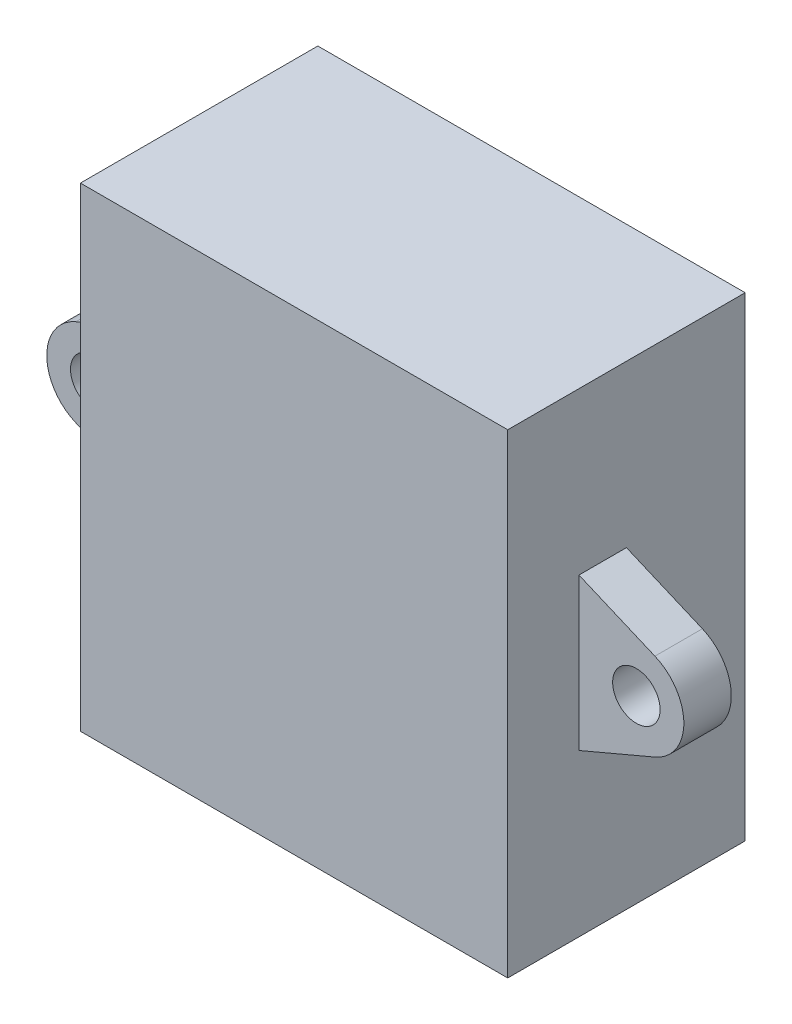
ISO-10303-21;
HEADER;
FILE_DESCRIPTION(('STEP AP214'),'2;1');
FILE_NAME('part.step','',(''),(''),'','','');
FILE_SCHEMA(('AUTOMOTIVE_DESIGN { 1 0 10303 214 1 1 1 1 }'));
ENDSEC;
DATA;
#1=APPLICATION_CONTEXT('core data for automotive mechanical design processes');
#2=APPLICATION_PROTOCOL_DEFINITION('international standard','automotive_design',2000,#1);
#3=PRODUCT_CONTEXT('',#1,'mechanical');
#4=PRODUCT('Part','Part','',(#3));
#5=PRODUCT_RELATED_PRODUCT_CATEGORY('part','',(#4));
#6=PRODUCT_DEFINITION_FORMATION('','',#4);
#7=PRODUCT_DEFINITION_CONTEXT('part definition',#1,'design');
#8=PRODUCT_DEFINITION('design','',#6,#7);
#9=PRODUCT_DEFINITION_SHAPE('','',#8);
#10=(LENGTH_UNIT() NAMED_UNIT(*) SI_UNIT(.MILLI.,.METRE.));
#11=(NAMED_UNIT(*) PLANE_ANGLE_UNIT() SI_UNIT($,.RADIAN.));
#12=(NAMED_UNIT(*) SI_UNIT($,.STERADIAN.) SOLID_ANGLE_UNIT());
#13=UNCERTAINTY_MEASURE_WITH_UNIT(LENGTH_MEASURE(1.E-05),#10,'distance_accuracy_value','');
#14=(GEOMETRIC_REPRESENTATION_CONTEXT(3) GLOBAL_UNCERTAINTY_ASSIGNED_CONTEXT((#13)) GLOBAL_UNIT_ASSIGNED_CONTEXT((#10,
#11,#12)) REPRESENTATION_CONTEXT('',''));
#15=CARTESIAN_POINT('',(0.,0.,0.));
#16=DIRECTION('',(0.,0.,1.));
#17=DIRECTION('',(1.,0.,0.));
#18=AXIS2_PLACEMENT_3D('',#15,#16,#17);
#19=CARTESIAN_POINT('',(-30.4976629216678,0.,15.));
#20=DIRECTION('',(1.,0.,0.));
#21=DIRECTION('',(0.,1.,0.));
#22=AXIS2_PLACEMENT_3D('',#19,#20,#21);
#23=PLANE('',#22);
#24=DIRECTION('',(0.,-1.,0.));
#25=VECTOR('',#24,1.);
#26=CARTESIAN_POINT('',(-30.4976629216678,0.,0.));
#27=LINE('',#26,#25);
#28=CARTESIAN_POINT('',(-30.4976629216678,-5.89748609275845,0.));
#29=VERTEX_POINT('',#28);
#30=CARTESIAN_POINT('',(-30.4976629216678,-35.8974860927584,0.));
#31=VERTEX_POINT('',#30);
#32=EDGE_CURVE('E189',#29,#31,#27,.T.);
#33=ORIENTED_EDGE('',*,*,#32,.F.);
#34=DIRECTION('',(0.,0.,-1.));
#35=VECTOR('',#34,1.);
#36=CARTESIAN_POINT('',(-30.4976629216678,-5.89748609275845,15.));
#37=LINE('',#36,#35);
#38=CARTESIAN_POINT('',(-30.4976629216678,-5.89748609275845,15.));
#39=VERTEX_POINT('',#38);
#40=EDGE_CURVE('E11',#39,#29,#37,.T.);
#41=ORIENTED_EDGE('',*,*,#40,.F.);
#42=DIRECTION('',(0.,-1.,0.));
#43=VECTOR('',#42,1.);
#44=CARTESIAN_POINT('',(-30.4976629216678,0.,15.));
#45=LINE('',#44,#43);
#46=CARTESIAN_POINT('',(-30.4976629216678,-35.8974860927584,15.));
#47=VERTEX_POINT('',#46);
#48=EDGE_CURVE('E190',#39,#47,#45,.T.);
#49=ORIENTED_EDGE('',*,*,#48,.T.);
#50=DIRECTION('',(0.,0.,-1.));
#51=VECTOR('',#50,1.);
#52=CARTESIAN_POINT('',(-30.4976629216678,-35.8974860927584,15.));
#53=LINE('',#52,#51);
#54=EDGE_CURVE('E201',#47,#31,#53,.T.);
#55=ORIENTED_EDGE('',*,*,#54,.T.);
#56=EDGE_LOOP('',(#33,#41,#49,#55));
#57=FACE_BOUND('',#56,.T.);
#58=DIRECTION('',(0.,0.,-1.));
#59=VECTOR('',#58,1.);
#60=CARTESIAN_POINT('',(-30.4976629216678,-16.0974860927584,10.5));
#61=LINE('',#60,#59);
#62=CARTESIAN_POINT('',(-30.4976629216678,-16.0974860927584,10.5));
#63=VERTEX_POINT('',#62);
#64=CARTESIAN_POINT('',(-30.4976629216678,-16.0974860927584,7.5));
#65=VERTEX_POINT('',#64);
#66=EDGE_CURVE('E171',#63,#65,#61,.T.);
#67=ORIENTED_EDGE('',*,*,#66,.T.);
#68=DIRECTION('',(0.,-1.,0.));
#69=VECTOR('',#68,1.);
#70=CARTESIAN_POINT('',(-30.4976629216678,-16.0974860927584,7.5));
#71=LINE('',#70,#69);
#72=CARTESIAN_POINT('',(-30.4976629216678,-25.6974860927584,7.5));
#73=VERTEX_POINT('',#72);
#74=EDGE_CURVE('E57',#65,#73,#71,.T.);
#75=ORIENTED_EDGE('',*,*,#74,.T.);
#76=DIRECTION('',(0.,0.,-1.));
#77=VECTOR('',#76,1.);
#78=CARTESIAN_POINT('',(-30.4976629216678,-25.6974860927584,10.5));
#79=LINE('',#78,#77);
#80=CARTESIAN_POINT('',(-30.4976629216678,-25.6974860927584,10.5));
#81=VERTEX_POINT('',#80);
#82=EDGE_CURVE('E186',#81,#73,#79,.T.);
#83=ORIENTED_EDGE('',*,*,#82,.F.);
#84=DIRECTION('',(0.,-1.,0.));
#85=VECTOR('',#84,1.);
#86=CARTESIAN_POINT('',(-30.4976629216678,-16.0974860927584,10.5));
#87=LINE('',#86,#85);
#88=EDGE_CURVE('E161',#63,#81,#87,.T.);
#89=ORIENTED_EDGE('',*,*,#88,.F.);
#90=EDGE_LOOP('',(#67,#75,#83,#89));
#91=FACE_BOUND('',#90,.T.);
#92=ADVANCED_FACE('F35',(#57,#91),#23,.T.);
#93=CARTESIAN_POINT('',(0.,-5.89748609275845,15.));
#94=DIRECTION('',(0.,1.,0.));
#95=DIRECTION('',(0.,0.,1.));
#96=AXIS2_PLACEMENT_3D('',#93,#94,#95);
#97=PLANE('',#96);
#98=DIRECTION('',(1.,0.,0.));
#99=VECTOR('',#98,1.);
#100=CARTESIAN_POINT('',(0.,-5.89748609275845,0.));
#101=LINE('',#100,#99);
#102=CARTESIAN_POINT('',(-57.4976629216678,-5.89748609275845,0.));
#103=VERTEX_POINT('',#102);
#104=EDGE_CURVE('E204',#103,#29,#101,.T.);
#105=ORIENTED_EDGE('',*,*,#104,.F.);
#106=DIRECTION('',(0.,0.,-1.));
#107=VECTOR('',#106,1.);
#108=CARTESIAN_POINT('',(-57.4976629216678,-5.89748609275845,15.));
#109=LINE('',#108,#107);
#110=CARTESIAN_POINT('',(-57.4976629216678,-5.89748609275845,15.));
#111=VERTEX_POINT('',#110);
#112=EDGE_CURVE('E42',#111,#103,#109,.T.);
#113=ORIENTED_EDGE('',*,*,#112,.F.);
#114=DIRECTION('',(1.,0.,0.));
#115=VECTOR('',#114,1.);
#116=CARTESIAN_POINT('',(0.,-5.89748609275845,15.));
#117=LINE('',#116,#115);
#118=EDGE_CURVE('E193',#111,#39,#117,.T.);
#119=ORIENTED_EDGE('',*,*,#118,.T.);
#120=ORIENTED_EDGE('',*,*,#40,.T.);
#121=EDGE_LOOP('',(#105,#113,#119,#120));
#122=FACE_BOUND('',#121,.T.);
#123=ADVANCED_FACE('F225',(#122),#97,.T.);
#124=CARTESIAN_POINT('',(-57.4976629216678,0.,15.));
#125=DIRECTION('',(1.,0.,0.));
#126=DIRECTION('',(0.,1.,0.));
#127=AXIS2_PLACEMENT_3D('',#124,#125,#126);
#128=PLANE('',#127);
#129=DIRECTION('',(0.,0.,-1.));
#130=VECTOR('',#129,1.);
#131=CARTESIAN_POINT('',(-57.4976629216677,-25.6974860927585,10.5));
#132=LINE('',#131,#130);
#133=CARTESIAN_POINT('',(-57.4976629216677,-25.6974860927585,10.5));
#134=VERTEX_POINT('',#133);
#135=CARTESIAN_POINT('',(-57.4976629216677,-25.6974860927585,7.5));
#136=VERTEX_POINT('',#135);
#137=EDGE_CURVE('E131',#134,#136,#132,.T.);
#138=ORIENTED_EDGE('',*,*,#137,.T.);
#139=DIRECTION('',(0.,1.,0.));
#140=VECTOR('',#139,1.);
#141=CARTESIAN_POINT('',(-57.4976629216678,-16.0974860927584,7.5));
#142=LINE('',#141,#140);
#143=CARTESIAN_POINT('',(-57.4976629216678,-16.0974860927584,7.5));
#144=VERTEX_POINT('',#143);
#145=EDGE_CURVE('E49',#136,#144,#142,.T.);
#146=ORIENTED_EDGE('',*,*,#145,.T.);
#147=DIRECTION('',(0.,0.,-1.));
#148=VECTOR('',#147,1.);
#149=CARTESIAN_POINT('',(-57.4976629216678,-16.0974860927584,10.5));
#150=LINE('',#149,#148);
#151=CARTESIAN_POINT('',(-57.4976629216678,-16.0974860927584,10.5));
#152=VERTEX_POINT('',#151);
#153=EDGE_CURVE('E155',#152,#144,#150,.T.);
#154=ORIENTED_EDGE('',*,*,#153,.F.);
#155=DIRECTION('',(0.,1.,0.));
#156=VECTOR('',#155,1.);
#157=CARTESIAN_POINT('',(-57.4976629216678,-16.0974860927584,10.5));
#158=LINE('',#157,#156);
#159=EDGE_CURVE('E134',#134,#152,#158,.T.);
#160=ORIENTED_EDGE('',*,*,#159,.F.);
#161=EDGE_LOOP('',(#138,#146,#154,#160));
#162=FACE_BOUND('',#161,.T.);
#163=DIRECTION('',(0.,-1.,0.));
#164=VECTOR('',#163,1.);
#165=CARTESIAN_POINT('',(-57.4976629216678,0.,0.));
#166=LINE('',#165,#164);
#167=CARTESIAN_POINT('',(-57.4976629216677,-35.8974860927584,0.));
#168=VERTEX_POINT('',#167);
#169=EDGE_CURVE('E207',#103,#168,#166,.T.);
#170=ORIENTED_EDGE('',*,*,#169,.T.);
#171=DIRECTION('',(0.,0.,-1.));
#172=VECTOR('',#171,1.);
#173=CARTESIAN_POINT('',(-57.4976629216677,-35.8974860927584,15.));
#174=LINE('',#173,#172);
#175=CARTESIAN_POINT('',(-57.4976629216677,-35.8974860927584,15.));
#176=VERTEX_POINT('',#175);
#177=EDGE_CURVE('E212',#176,#168,#174,.T.);
#178=ORIENTED_EDGE('',*,*,#177,.F.);
#179=DIRECTION('',(0.,-1.,0.));
#180=VECTOR('',#179,1.);
#181=CARTESIAN_POINT('',(-57.4976629216678,0.,15.));
#182=LINE('',#181,#180);
#183=EDGE_CURVE('E197',#111,#176,#182,.T.);
#184=ORIENTED_EDGE('',*,*,#183,.F.);
#185=ORIENTED_EDGE('',*,*,#112,.T.);
#186=EDGE_LOOP('',(#170,#178,#184,#185));
#187=FACE_BOUND('',#186,.T.);
#188=ADVANCED_FACE('F217',(#162,#187),#128,.F.);
#189=CARTESIAN_POINT('',(0.,-35.8974860927584,15.));
#190=DIRECTION('',(0.,1.,0.));
#191=DIRECTION('',(0.,0.,1.));
#192=AXIS2_PLACEMENT_3D('',#189,#190,#191);
#193=PLANE('',#192);
#194=DIRECTION('',(1.,0.,0.));
#195=VECTOR('',#194,1.);
#196=CARTESIAN_POINT('',(0.,-35.8974860927584,0.));
#197=LINE('',#196,#195);
#198=EDGE_CURVE('E194',#168,#31,#197,.T.);
#199=ORIENTED_EDGE('',*,*,#198,.T.);
#200=ORIENTED_EDGE('',*,*,#54,.F.);
#201=DIRECTION('',(1.,0.,0.));
#202=VECTOR('',#201,1.);
#203=CARTESIAN_POINT('',(0.,-35.8974860927584,15.));
#204=LINE('',#203,#202);
#205=EDGE_CURVE('E199',#176,#47,#204,.T.);
#206=ORIENTED_EDGE('',*,*,#205,.F.);
#207=ORIENTED_EDGE('',*,*,#177,.T.);
#208=EDGE_LOOP('',(#199,#200,#206,#207));
#209=FACE_BOUND('',#208,.T.);
#210=ADVANCED_FACE('F233',(#209),#193,.F.);
#211=CARTESIAN_POINT('',(0.,0.,15.));
#212=DIRECTION('',(0.,0.,1.));
#213=DIRECTION('',(1.,0.,0.));
#214=AXIS2_PLACEMENT_3D('',#211,#212,#213);
#215=PLANE('',#214);
#216=ORIENTED_EDGE('',*,*,#48,.F.);
#217=ORIENTED_EDGE('',*,*,#118,.F.);
#218=ORIENTED_EDGE('',*,*,#183,.T.);
#219=ORIENTED_EDGE('',*,*,#205,.T.);
#220=EDGE_LOOP('',(#216,#217,#218,#219));
#221=FACE_BOUND('',#220,.T.);
#222=ADVANCED_FACE('F235',(#221),#215,.T.);
#223=CARTESIAN_POINT('',(0.,0.,0.));
#224=DIRECTION('',(0.,0.,1.));
#225=DIRECTION('',(1.,0.,0.));
#226=AXIS2_PLACEMENT_3D('',#223,#224,#225);
#227=PLANE('',#226);
#228=ORIENTED_EDGE('',*,*,#32,.T.);
#229=ORIENTED_EDGE('',*,*,#198,.F.);
#230=ORIENTED_EDGE('',*,*,#169,.F.);
#231=ORIENTED_EDGE('',*,*,#104,.T.);
#232=EDGE_LOOP('',(#228,#229,#230,#231));
#233=FACE_BOUND('',#232,.T.);
#234=ADVANCED_FACE('F224',(#233),#227,.F.);
#235=CARTESIAN_POINT('',(-26.8704748037808,-20.8974860927584,10.5));
#236=DIRECTION('',(0.,0.,1.));
#237=DIRECTION('',(1.,0.,0.));
#238=AXIS2_PLACEMENT_3D('',#235,#236,#237);
#239=PLANE('',#238);
#240=ORIENTED_EDGE('',*,*,#88,.T.);
#241=DIRECTION('',(0.920417314119249,0.390937294037686,0.));
#242=VECTOR('',#241,1.);
#243=CARTESIAN_POINT('',(-25.6976629216678,-23.6587380351162,10.5));
#244=LINE('',#243,#242);
#245=CARTESIAN_POINT('',(-25.6976629216678,-23.6587380351162,10.5));
#246=VERTEX_POINT('',#245);
#247=EDGE_CURVE('E164',#81,#246,#244,.T.);
#248=ORIENTED_EDGE('',*,*,#247,.T.);
#249=CARTESIAN_POINT('',(-26.8704748037808,-20.8974860927584,10.5));
#250=DIRECTION('',(0.,0.,1.));
#251=DIRECTION('',(1.,0.,0.));
#252=AXIS2_PLACEMENT_3D('',#249,#250,#251);
#253=CIRCLE('',#252,3.00000000000001);
#254=CARTESIAN_POINT('',(-25.6976629216678,-18.1362341504007,10.5));
#255=VERTEX_POINT('',#254);
#256=EDGE_CURVE('E167',#246,#255,#253,.T.);
#257=ORIENTED_EDGE('',*,*,#256,.T.);
#258=DIRECTION('',(-0.920417314119247,0.390937294037689,0.));
#259=VECTOR('',#258,1.);
#260=CARTESIAN_POINT('',(-30.4976629216678,-16.0974860927584,10.5));
#261=LINE('',#260,#259);
#262=EDGE_CURVE('E169',#255,#63,#261,.T.);
#263=ORIENTED_EDGE('',*,*,#262,.T.);
#264=EDGE_LOOP('',(#240,#248,#257,#263));
#265=FACE_BOUND('',#264,.T.);
#266=CARTESIAN_POINT('',(-26.8704748037808,-20.8974860927584,10.5));
#267=DIRECTION('',(0.,0.,1.));
#268=DIRECTION('',(1.,0.,0.));
#269=AXIS2_PLACEMENT_3D('',#266,#267,#268);
#270=CIRCLE('',#269,1.5);
#271=CARTESIAN_POINT('',(-25.3704748037808,-20.8974860927584,10.5));
#272=VERTEX_POINT('',#271);
#273=EDGE_CURVE('E153',#272,#272,#270,.T.);
#274=ORIENTED_EDGE('',*,*,#273,.F.);
#275=EDGE_LOOP('',(#274));
#276=FACE_BOUND('',#275,.T.);
#277=ADVANCED_FACE('F242',(#265,#276),#239,.T.);
#278=CARTESIAN_POINT('',(-26.8704748037808,-20.8974860927584,7.5));
#279=DIRECTION('',(0.,0.,1.));
#280=DIRECTION('',(1.,0.,0.));
#281=AXIS2_PLACEMENT_3D('',#278,#279,#280);
#282=PLANE('',#281);
#283=ORIENTED_EDGE('',*,*,#74,.F.);
#284=DIRECTION('',(-0.920417314119247,0.390937294037689,0.));
#285=VECTOR('',#284,1.);
#286=CARTESIAN_POINT('',(-30.4976629216678,-16.0974860927584,7.5));
#287=LINE('',#286,#285);
#288=CARTESIAN_POINT('',(-25.6976629216678,-18.1362341504007,7.5));
#289=VERTEX_POINT('',#288);
#290=EDGE_CURVE('E165',#289,#65,#287,.T.);
#291=ORIENTED_EDGE('',*,*,#290,.F.);
#292=CARTESIAN_POINT('',(-26.8704748037808,-20.8974860927584,7.5));
#293=DIRECTION('',(0.,0.,1.));
#294=DIRECTION('',(1.,0.,0.));
#295=AXIS2_PLACEMENT_3D('',#292,#293,#294);
#296=CIRCLE('',#295,3.00000000000001);
#297=CARTESIAN_POINT('',(-25.6976629216678,-23.6587380351162,7.5));
#298=VERTEX_POINT('',#297);
#299=EDGE_CURVE('E175',#298,#289,#296,.T.);
#300=ORIENTED_EDGE('',*,*,#299,.F.);
#301=DIRECTION('',(0.920417314119249,0.390937294037686,0.));
#302=VECTOR('',#301,1.);
#303=CARTESIAN_POINT('',(-25.6976629216678,-23.6587380351162,7.5));
#304=LINE('',#303,#302);
#305=EDGE_CURVE('E173',#73,#298,#304,.T.);
#306=ORIENTED_EDGE('',*,*,#305,.F.);
#307=EDGE_LOOP('',(#283,#291,#300,#306));
#308=FACE_BOUND('',#307,.T.);
#309=CARTESIAN_POINT('',(-26.8704748037808,-20.8974860927584,7.5));
#310=DIRECTION('',(0.,0.,1.));
#311=DIRECTION('',(1.,0.,0.));
#312=AXIS2_PLACEMENT_3D('',#309,#310,#311);
#313=CIRCLE('',#312,1.5);
#314=CARTESIAN_POINT('',(-25.3704748037808,-20.8974860927584,7.5));
#315=VERTEX_POINT('',#314);
#316=EDGE_CURVE('E150',#315,#315,#313,.T.);
#317=ORIENTED_EDGE('',*,*,#316,.T.);
#318=EDGE_LOOP('',(#317));
#319=FACE_BOUND('',#318,.T.);
#320=ADVANCED_FACE('F303',(#308,#319),#282,.F.);
#321=CARTESIAN_POINT('',(-25.6976629216678,-23.6587380351162,10.5));
#322=DIRECTION('',(-0.390937294037686,0.920417314119249,0.));
#323=DIRECTION('',(-0.920417314119249,-0.390937294037686,0.));
#324=AXIS2_PLACEMENT_3D('',#321,#322,#323);
#325=PLANE('',#324);
#326=ORIENTED_EDGE('',*,*,#305,.T.);
#327=DIRECTION('',(0.,0.,-1.));
#328=VECTOR('',#327,1.);
#329=CARTESIAN_POINT('',(-25.6976629216678,-23.6587380351162,10.5));
#330=LINE('',#329,#328);
#331=EDGE_CURVE('E183',#246,#298,#330,.T.);
#332=ORIENTED_EDGE('',*,*,#331,.F.);
#333=ORIENTED_EDGE('',*,*,#247,.F.);
#334=ORIENTED_EDGE('',*,*,#82,.T.);
#335=EDGE_LOOP('',(#326,#332,#333,#334));
#336=FACE_BOUND('',#335,.T.);
#337=ADVANCED_FACE('F307',(#336),#325,.F.);
#338=CARTESIAN_POINT('',(-26.8704748037808,-20.8974860927584,10.5));
#339=DIRECTION('',(0.,0.,-1.));
#340=DIRECTION('',(-1.,0.,0.));
#341=AXIS2_PLACEMENT_3D('',#338,#339,#340);
#342=CYLINDRICAL_SURFACE('',#341,3.00000000000001);
#343=ORIENTED_EDGE('',*,*,#299,.T.);
#344=DIRECTION('',(0.,0.,-1.));
#345=VECTOR('',#344,1.);
#346=CARTESIAN_POINT('',(-25.6976629216678,-18.1362341504007,10.5));
#347=LINE('',#346,#345);
#348=EDGE_CURVE('E180',#255,#289,#347,.T.);
#349=ORIENTED_EDGE('',*,*,#348,.F.);
#350=ORIENTED_EDGE('',*,*,#256,.F.);
#351=ORIENTED_EDGE('',*,*,#331,.T.);
#352=EDGE_LOOP('',(#343,#349,#350,#351));
#353=FACE_BOUND('',#352,.T.);
#354=ADVANCED_FACE('F310',(#353),#342,.T.);
#355=CARTESIAN_POINT('',(-30.4976629216678,-16.0974860927584,10.5));
#356=DIRECTION('',(-0.390937294037689,-0.920417314119247,0.));
#357=DIRECTION('',(0.920417314119247,-0.390937294037689,0.));
#358=AXIS2_PLACEMENT_3D('',#355,#356,#357);
#359=PLANE('',#358);
#360=ORIENTED_EDGE('',*,*,#290,.T.);
#361=ORIENTED_EDGE('',*,*,#66,.F.);
#362=ORIENTED_EDGE('',*,*,#262,.F.);
#363=ORIENTED_EDGE('',*,*,#348,.T.);
#364=EDGE_LOOP('',(#360,#361,#362,#363));
#365=FACE_BOUND('',#364,.T.);
#366=ADVANCED_FACE('F290',(#365),#359,.F.);
#367=CARTESIAN_POINT('',(-26.8704748037808,-20.8974860927584,10.5));
#368=DIRECTION('',(0.,0.,-1.));
#369=DIRECTION('',(-1.,0.,0.));
#370=AXIS2_PLACEMENT_3D('',#367,#368,#369);
#371=CYLINDRICAL_SURFACE('',#370,1.5);
#372=ORIENTED_EDGE('',*,*,#273,.T.);
#373=EDGE_LOOP('',(#372));
#374=FACE_BOUND('',#373,.T.);
#375=ORIENTED_EDGE('',*,*,#316,.F.);
#376=EDGE_LOOP('',(#375));
#377=FACE_BOUND('',#376,.T.);
#378=ADVANCED_FACE('F285',(#374,#377),#371,.F.);
#379=CARTESIAN_POINT('',(-61.1248510395547,-20.8974860927585,10.5));
#380=DIRECTION('',(0.,0.,-1.));
#381=DIRECTION('',(-1.,0.,0.));
#382=AXIS2_PLACEMENT_3D('',#379,#380,#381);
#383=PLANE('',#382);
#384=CARTESIAN_POINT('',(-61.1248510395547,-20.8974860927585,10.5));
#385=DIRECTION('',(0.,0.,1.));
#386=DIRECTION('',(-1.,0.,0.));
#387=AXIS2_PLACEMENT_3D('',#384,#385,#386);
#388=CIRCLE('',#387,3.00000000000001);
#389=CARTESIAN_POINT('',(-62.2976629216678,-18.1362341504007,10.5));
#390=VERTEX_POINT('',#389);
#391=CARTESIAN_POINT('',(-62.2976629216677,-23.6587380351162,10.5));
#392=VERTEX_POINT('',#391);
#393=EDGE_CURVE('E135',#390,#392,#388,.T.);
#394=ORIENTED_EDGE('',*,*,#393,.T.);
#395=DIRECTION('',(0.920417314119249,-0.390937294037685,0.));
#396=VECTOR('',#395,1.);
#397=CARTESIAN_POINT('',(-62.2976629216677,-23.6587380351162,10.5));
#398=LINE('',#397,#396);
#399=EDGE_CURVE('E124',#392,#134,#398,.T.);
#400=ORIENTED_EDGE('',*,*,#399,.T.);
#401=ORIENTED_EDGE('',*,*,#159,.T.);
#402=DIRECTION('',(-0.920417314119247,-0.390937294037691,0.));
#403=VECTOR('',#402,1.);
#404=CARTESIAN_POINT('',(-57.4976629216678,-16.0974860927584,10.5));
#405=LINE('',#404,#403);
#406=EDGE_CURVE('E141',#152,#390,#405,.T.);
#407=ORIENTED_EDGE('',*,*,#406,.T.);
#408=EDGE_LOOP('',(#394,#400,#401,#407));
#409=FACE_BOUND('',#408,.T.);
#410=CARTESIAN_POINT('',(-61.1248510395547,-20.8974860927585,10.5));
#411=DIRECTION('',(0.,0.,1.));
#412=DIRECTION('',(-1.,0.,0.));
#413=AXIS2_PLACEMENT_3D('',#410,#411,#412);
#414=CIRCLE('',#413,1.5);
#415=CARTESIAN_POINT('',(-62.6248510395547,-20.8974860927585,10.5));
#416=VERTEX_POINT('',#415);
#417=EDGE_CURVE('E264',#416,#416,#414,.T.);
#418=ORIENTED_EDGE('',*,*,#417,.F.);
#419=EDGE_LOOP('',(#418));
#420=FACE_BOUND('',#419,.T.);
#421=ADVANCED_FACE('F138',(#409,#420),#383,.F.);
#422=CARTESIAN_POINT('',(-61.1248510395547,-20.8974860927585,7.5));
#423=DIRECTION('',(0.,0.,-1.));
#424=DIRECTION('',(-1.,0.,0.));
#425=AXIS2_PLACEMENT_3D('',#422,#423,#424);
#426=PLANE('',#425);
#427=CARTESIAN_POINT('',(-61.1248510395547,-20.8974860927585,7.5));
#428=DIRECTION('',(0.,0.,1.));
#429=DIRECTION('',(-1.,0.,0.));
#430=AXIS2_PLACEMENT_3D('',#427,#428,#429);
#431=CIRCLE('',#430,3.00000000000001);
#432=CARTESIAN_POINT('',(-62.2976629216678,-18.1362341504007,7.5));
#433=VERTEX_POINT('',#432);
#434=CARTESIAN_POINT('',(-62.2976629216677,-23.6587380351162,7.5));
#435=VERTEX_POINT('',#434);
#436=EDGE_CURVE('E149',#433,#435,#431,.T.);
#437=ORIENTED_EDGE('',*,*,#436,.F.);
#438=DIRECTION('',(-0.920417314119247,-0.390937294037691,0.));
#439=VECTOR('',#438,1.);
#440=CARTESIAN_POINT('',(-57.4976629216678,-16.0974860927584,7.5));
#441=LINE('',#440,#439);
#442=EDGE_CURVE('E145',#144,#433,#441,.T.);
#443=ORIENTED_EDGE('',*,*,#442,.F.);
#444=ORIENTED_EDGE('',*,*,#145,.F.);
#445=DIRECTION('',(0.920417314119249,-0.390937294037685,0.));
#446=VECTOR('',#445,1.);
#447=CARTESIAN_POINT('',(-62.2976629216677,-23.6587380351162,7.5));
#448=LINE('',#447,#446);
#449=EDGE_CURVE('E263',#435,#136,#448,.T.);
#450=ORIENTED_EDGE('',*,*,#449,.F.);
#451=EDGE_LOOP('',(#437,#443,#444,#450));
#452=FACE_BOUND('',#451,.T.);
#453=CARTESIAN_POINT('',(-61.1248510395547,-20.8974860927585,7.5));
#454=DIRECTION('',(0.,0.,1.));
#455=DIRECTION('',(-1.,0.,0.));
#456=AXIS2_PLACEMENT_3D('',#453,#454,#455);
#457=CIRCLE('',#456,1.5);
#458=CARTESIAN_POINT('',(-62.6248510395547,-20.8974860927585,7.5));
#459=VERTEX_POINT('',#458);
#460=EDGE_CURVE('E276',#459,#459,#457,.T.);
#461=ORIENTED_EDGE('',*,*,#460,.T.);
#462=EDGE_LOOP('',(#461));
#463=FACE_BOUND('',#462,.T.);
#464=ADVANCED_FACE('F270',(#452,#463),#426,.T.);
#465=CARTESIAN_POINT('',(-61.1248510395547,-20.8974860927585,10.5));
#466=DIRECTION('',(0.,0.,-1.));
#467=DIRECTION('',(-1.,0.,0.));
#468=AXIS2_PLACEMENT_3D('',#465,#466,#467);
#469=CYLINDRICAL_SURFACE('',#468,3.00000000000001);
#470=ORIENTED_EDGE('',*,*,#436,.T.);
#471=DIRECTION('',(0.,0.,-1.));
#472=VECTOR('',#471,1.);
#473=CARTESIAN_POINT('',(-62.2976629216677,-23.6587380351162,10.5));
#474=LINE('',#473,#472);
#475=EDGE_CURVE('E128',#392,#435,#474,.T.);
#476=ORIENTED_EDGE('',*,*,#475,.F.);
#477=ORIENTED_EDGE('',*,*,#393,.F.);
#478=DIRECTION('',(0.,0.,-1.));
#479=VECTOR('',#478,1.);
#480=CARTESIAN_POINT('',(-62.2976629216678,-18.1362341504007,10.5));
#481=LINE('',#480,#479);
#482=EDGE_CURVE('E259',#390,#433,#481,.T.);
#483=ORIENTED_EDGE('',*,*,#482,.T.);
#484=EDGE_LOOP('',(#470,#476,#477,#483));
#485=FACE_BOUND('',#484,.T.);
#486=ADVANCED_FACE('F147',(#485),#469,.T.);
#487=CARTESIAN_POINT('',(-62.2976629216677,-23.6587380351162,10.5));
#488=DIRECTION('',(0.390937294037685,0.920417314119249,0.));
#489=DIRECTION('',(-0.920417314119249,0.390937294037685,0.));
#490=AXIS2_PLACEMENT_3D('',#487,#488,#489);
#491=PLANE('',#490);
#492=ORIENTED_EDGE('',*,*,#449,.T.);
#493=ORIENTED_EDGE('',*,*,#137,.F.);
#494=ORIENTED_EDGE('',*,*,#399,.F.);
#495=ORIENTED_EDGE('',*,*,#475,.T.);
#496=EDGE_LOOP('',(#492,#493,#494,#495));
#497=FACE_BOUND('',#496,.T.);
#498=ADVANCED_FACE('F126',(#497),#491,.F.);
#499=CARTESIAN_POINT('',(-57.4976629216678,-16.0974860927584,10.5));
#500=DIRECTION('',(0.390937294037691,-0.920417314119247,0.));
#501=DIRECTION('',(0.920417314119247,0.390937294037691,0.));
#502=AXIS2_PLACEMENT_3D('',#499,#500,#501);
#503=PLANE('',#502);
#504=ORIENTED_EDGE('',*,*,#442,.T.);
#505=ORIENTED_EDGE('',*,*,#482,.F.);
#506=ORIENTED_EDGE('',*,*,#406,.F.);
#507=ORIENTED_EDGE('',*,*,#153,.T.);
#508=EDGE_LOOP('',(#504,#505,#506,#507));
#509=FACE_BOUND('',#508,.T.);
#510=ADVANCED_FACE('F269',(#509),#503,.F.);
#511=CARTESIAN_POINT('',(-61.1248510395547,-20.8974860927585,10.5));
#512=DIRECTION('',(0.,0.,-1.));
#513=DIRECTION('',(-1.,0.,0.));
#514=AXIS2_PLACEMENT_3D('',#511,#512,#513);
#515=CYLINDRICAL_SURFACE('',#514,1.5);
#516=ORIENTED_EDGE('',*,*,#417,.T.);
#517=EDGE_LOOP('',(#516));
#518=FACE_BOUND('',#517,.T.);
#519=ORIENTED_EDGE('',*,*,#460,.F.);
#520=EDGE_LOOP('',(#519));
#521=FACE_BOUND('',#520,.T.);
#522=ADVANCED_FACE('F283',(#518,#521),#515,.F.);
#523=CLOSED_SHELL('',(#92,#123,#188,#210,#222,#234,#277,#320,#337,#354,#366,#378,#421,#464,#486,
#498,#510,#522));
#524=MANIFOLD_SOLID_BREP('B2',#523);
#525=ADVANCED_BREP_SHAPE_REPRESENTATION('',(#18,#524),#14);
#526=SHAPE_DEFINITION_REPRESENTATION(#9,#525);
ENDSEC;
END-ISO-10303-21;
